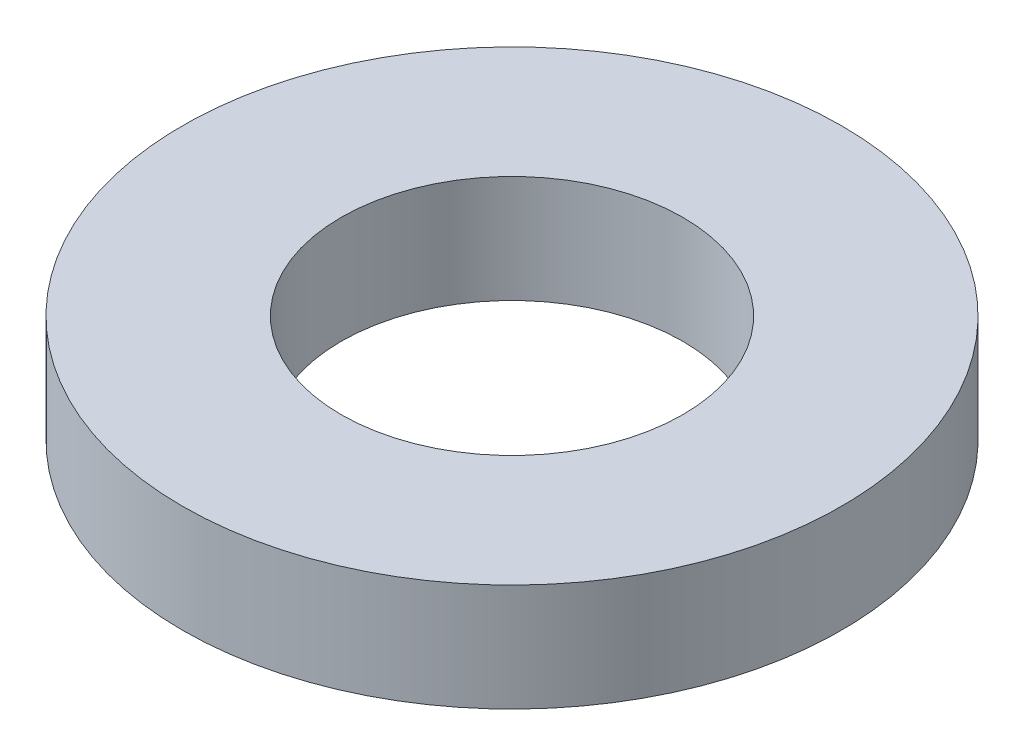
ISO-10303-21;
HEADER;
FILE_DESCRIPTION(('STEP AP214'),'2;1');
FILE_NAME('part.step','',(''),(''),'','','');
FILE_SCHEMA(('AUTOMOTIVE_DESIGN { 1 0 10303 214 1 1 1 1 }'));
ENDSEC;
DATA;
#1=APPLICATION_CONTEXT('core data for automotive mechanical design processes');
#2=APPLICATION_PROTOCOL_DEFINITION('international standard','automotive_design',2000,#1);
#3=PRODUCT_CONTEXT('',#1,'mechanical');
#4=PRODUCT('Part','Part','',(#3));
#5=PRODUCT_RELATED_PRODUCT_CATEGORY('part','',(#4));
#6=PRODUCT_DEFINITION_FORMATION('','',#4);
#7=PRODUCT_DEFINITION_CONTEXT('part definition',#1,'design');
#8=PRODUCT_DEFINITION('design','',#6,#7);
#9=PRODUCT_DEFINITION_SHAPE('','',#8);
#10=(LENGTH_UNIT() NAMED_UNIT(*) SI_UNIT(.MILLI.,.METRE.));
#11=(NAMED_UNIT(*) PLANE_ANGLE_UNIT() SI_UNIT($,.RADIAN.));
#12=(NAMED_UNIT(*) SI_UNIT($,.STERADIAN.) SOLID_ANGLE_UNIT());
#13=UNCERTAINTY_MEASURE_WITH_UNIT(LENGTH_MEASURE(1.E-05),#10,'distance_accuracy_value','');
#14=(GEOMETRIC_REPRESENTATION_CONTEXT(3) GLOBAL_UNCERTAINTY_ASSIGNED_CONTEXT((#13)) GLOBAL_UNIT_ASSIGNED_CONTEXT((#10,
#11,#12)) REPRESENTATION_CONTEXT('',''));
#15=CARTESIAN_POINT('',(0.,0.,0.));
#16=DIRECTION('',(0.,0.,1.));
#17=DIRECTION('',(1.,0.,0.));
#18=AXIS2_PLACEMENT_3D('',#15,#16,#17);
#19=CARTESIAN_POINT('',(0.,22.,0.));
#20=DIRECTION('',(0.,-1.,0.));
#21=DIRECTION('',(0.,0.,-1.));
#22=AXIS2_PLACEMENT_3D('',#19,#20,#21);
#23=CYLINDRICAL_SURFACE('',#22,67.5);
#24=CARTESIAN_POINT('',(0.,22.,0.));
#25=DIRECTION('',(0.,1.,0.));
#26=DIRECTION('',(0.,0.,1.));
#27=AXIS2_PLACEMENT_3D('',#24,#25,#26);
#28=CIRCLE('',#27,67.5);
#29=CARTESIAN_POINT('',(0.,22.,67.5));
#30=VERTEX_POINT('',#29);
#31=EDGE_CURVE('E10',#30,#30,#28,.T.);
#32=ORIENTED_EDGE('',*,*,#31,.F.);
#33=EDGE_LOOP('',(#32));
#34=FACE_BOUND('',#33,.T.);
#35=CARTESIAN_POINT('',(0.,0.,0.));
#36=DIRECTION('',(0.,1.,0.));
#37=DIRECTION('',(0.,0.,1.));
#38=AXIS2_PLACEMENT_3D('',#35,#36,#37);
#39=CIRCLE('',#38,67.5);
#40=CARTESIAN_POINT('',(0.,0.,67.5));
#41=VERTEX_POINT('',#40);
#42=EDGE_CURVE('E37',#41,#41,#39,.T.);
#43=ORIENTED_EDGE('',*,*,#42,.T.);
#44=EDGE_LOOP('',(#43));
#45=FACE_BOUND('',#44,.T.);
#46=ADVANCED_FACE('F40',(#34,#45),#23,.T.);
#47=CARTESIAN_POINT('',(0.,22.,0.));
#48=DIRECTION('',(0.,1.,0.));
#49=DIRECTION('',(0.,0.,1.));
#50=AXIS2_PLACEMENT_3D('',#47,#48,#49);
#51=PLANE('',#50);
#52=CARTESIAN_POINT('',(0.,22.,0.));
#53=DIRECTION('',(0.,1.,0.));
#54=DIRECTION('',(0.,0.,1.));
#55=AXIS2_PLACEMENT_3D('',#52,#53,#54);
#56=CIRCLE('',#55,35.);
#57=CARTESIAN_POINT('',(0.,22.,35.));
#58=VERTEX_POINT('',#57);
#59=EDGE_CURVE('E50',#58,#58,#56,.T.);
#60=ORIENTED_EDGE('',*,*,#59,.F.);
#61=EDGE_LOOP('',(#60));
#62=FACE_BOUND('',#61,.T.);
#63=ORIENTED_EDGE('',*,*,#31,.T.);
#64=EDGE_LOOP('',(#63));
#65=FACE_BOUND('',#64,.T.);
#66=ADVANCED_FACE('F59',(#62,#65),#51,.T.);
#67=CARTESIAN_POINT('',(0.,0.,0.));
#68=DIRECTION('',(0.,1.,0.));
#69=DIRECTION('',(0.,0.,1.));
#70=AXIS2_PLACEMENT_3D('',#67,#68,#69);
#71=PLANE('',#70);
#72=CARTESIAN_POINT('',(0.,0.,0.));
#73=DIRECTION('',(0.,1.,0.));
#74=DIRECTION('',(0.,0.,1.));
#75=AXIS2_PLACEMENT_3D('',#72,#73,#74);
#76=CIRCLE('',#75,35.);
#77=CARTESIAN_POINT('',(0.,0.,35.));
#78=VERTEX_POINT('',#77);
#79=EDGE_CURVE('E47',#78,#78,#76,.T.);
#80=ORIENTED_EDGE('',*,*,#79,.T.);
#81=EDGE_LOOP('',(#80));
#82=FACE_BOUND('',#81,.T.);
#83=ORIENTED_EDGE('',*,*,#42,.F.);
#84=EDGE_LOOP('',(#83));
#85=FACE_BOUND('',#84,.T.);
#86=ADVANCED_FACE('F58',(#82,#85),#71,.F.);
#87=CARTESIAN_POINT('',(0.,22.,0.));
#88=DIRECTION('',(0.,-1.,0.));
#89=DIRECTION('',(0.,0.,-1.));
#90=AXIS2_PLACEMENT_3D('',#87,#88,#89);
#91=CYLINDRICAL_SURFACE('',#90,35.);
#92=ORIENTED_EDGE('',*,*,#59,.T.);
#93=EDGE_LOOP('',(#92));
#94=FACE_BOUND('',#93,.T.);
#95=ORIENTED_EDGE('',*,*,#79,.F.);
#96=EDGE_LOOP('',(#95));
#97=FACE_BOUND('',#96,.T.);
#98=ADVANCED_FACE('F54',(#94,#97),#91,.F.);
#99=CLOSED_SHELL('',(#46,#66,#86,#98));
#100=MANIFOLD_SOLID_BREP('B2',#99);
#101=ADVANCED_BREP_SHAPE_REPRESENTATION('',(#18,#100),#14);
#102=SHAPE_DEFINITION_REPRESENTATION(#9,#101);
ENDSEC;
END-ISO-10303-21;
